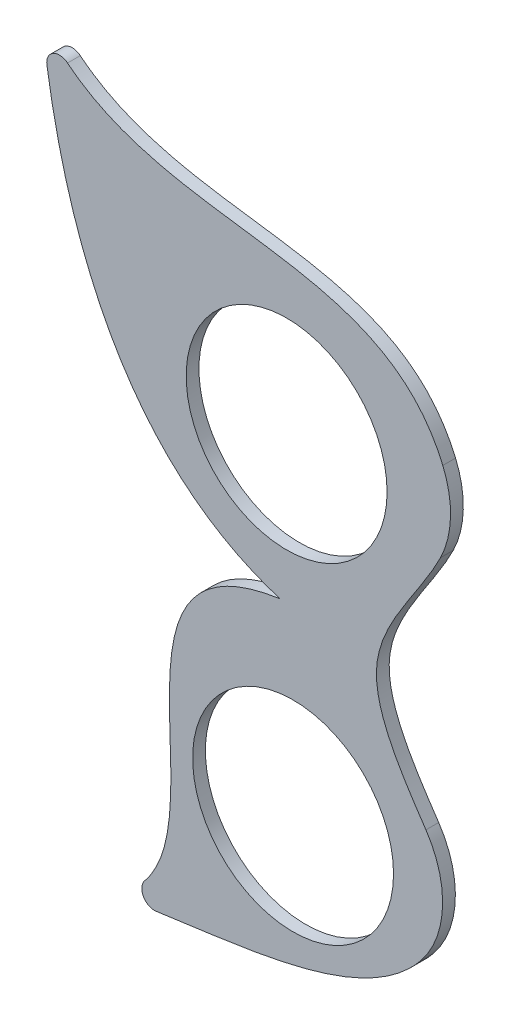
ISO-10303-21;
HEADER;
FILE_DESCRIPTION(('STEP AP214'),'2;1');
FILE_NAME('part.step','',(''),(''),'','','');
FILE_SCHEMA(('AUTOMOTIVE_DESIGN { 1 0 10303 214 1 1 1 1 }'));
ENDSEC;
DATA;
#1=APPLICATION_CONTEXT('core data for automotive mechanical design processes');
#2=APPLICATION_PROTOCOL_DEFINITION('international standard','automotive_design',2000,#1);
#3=PRODUCT_CONTEXT('',#1,'mechanical');
#4=PRODUCT('Part','Part','',(#3));
#5=PRODUCT_RELATED_PRODUCT_CATEGORY('part','',(#4));
#6=PRODUCT_DEFINITION_FORMATION('','',#4);
#7=PRODUCT_DEFINITION_CONTEXT('part definition',#1,'design');
#8=PRODUCT_DEFINITION('design','',#6,#7);
#9=PRODUCT_DEFINITION_SHAPE('','',#8);
#10=(LENGTH_UNIT() NAMED_UNIT(*) SI_UNIT(.MILLI.,.METRE.));
#11=(NAMED_UNIT(*) PLANE_ANGLE_UNIT() SI_UNIT($,.RADIAN.));
#12=(NAMED_UNIT(*) SI_UNIT($,.STERADIAN.) SOLID_ANGLE_UNIT());
#13=UNCERTAINTY_MEASURE_WITH_UNIT(LENGTH_MEASURE(1.E-05),#10,'distance_accuracy_value','');
#14=(GEOMETRIC_REPRESENTATION_CONTEXT(3) GLOBAL_UNCERTAINTY_ASSIGNED_CONTEXT((#13)) GLOBAL_UNIT_ASSIGNED_CONTEXT((#10,
#11,#12)) REPRESENTATION_CONTEXT('',''));
#15=CARTESIAN_POINT('',(0.,0.,0.));
#16=DIRECTION('',(0.,0.,1.));
#17=DIRECTION('',(1.,0.,0.));
#18=AXIS2_PLACEMENT_3D('',#15,#16,#17);
#19=CARTESIAN_POINT('',(47.4828996392039,257.347445507489,10.));
#20=DIRECTION('',(0.,0.,-1.));
#21=DIRECTION('',(-1.,0.,0.));
#22=AXIS2_PLACEMENT_3D('',#19,#20,#21);
#23=PLANE('',#22);
#24=CARTESIAN_POINT('',(54.2159168019038,24.2036270078242,10.));
#25=CARTESIAN_POINT('',(-114.622523084741,-0.554759509269772,10.));
#26=CARTESIAN_POINT('',(39.7835800245491,-196.678058189763,10.));
#27=CARTESIAN_POINT('',(-88.138107542117,-245.060353001385,10.));
#28=B_SPLINE_CURVE_WITH_KNOTS('',3,(#24,#25,#26,#27),.UNSPECIFIED.,.F.,.F.,(4,4),(0.,1.),.UNSPECIFIED.);
#29=CARTESIAN_POINT('',(54.2159168019038,24.2036270078242,10.));
#30=VERTEX_POINT('',#29);
#31=CARTESIAN_POINT('',(-51.8891233892457,-220.2154826426,10.));
#32=VERTEX_POINT('',#31);
#33=EDGE_CURVE('E107',#30,#32,#28,.T.);
#34=ORIENTED_EDGE('',*,*,#33,.T.);
#35=CARTESIAN_POINT('',(-44.1543989368596,-226.553781913356,10.));
#36=DIRECTION('',(0.,0.,-1.));
#37=DIRECTION('',(-1.,0.,0.));
#38=AXIS2_PLACEMENT_3D('',#35,#36,#37);
#39=CIRCLE('',#38,10.);
#40=CARTESIAN_POINT('',(-42.7045517097925,-236.448120851262,10.));
#41=VERTEX_POINT('',#40);
#42=EDGE_CURVE('E11',#32,#41,#39,.F.);
#43=ORIENTED_EDGE('',*,*,#42,.T.);
#44=CARTESIAN_POINT('',(-88.138107542117,-245.060353001385,10.));
#45=CARTESIAN_POINT('',(6.77991974455998,-220.260837551599,10.));
#46=CARTESIAN_POINT('',(192.981953107219,-238.762703419045,10.));
#47=CARTESIAN_POINT('',(190.267122197307,-81.8904100032855,10.));
#48=B_SPLINE_CURVE_WITH_KNOTS('',3,(#44,#45,#46,#47),.UNSPECIFIED.,.F.,.F.,(4,4),(0.,1.),.UNSPECIFIED.);
#49=CARTESIAN_POINT('',(164.242164409829,-166.605689524645,10.));
#50=VERTEX_POINT('',#49);
#51=EDGE_CURVE('E123',#41,#50,#48,.T.);
#52=ORIENTED_EDGE('',*,*,#51,.T.);
#53=CARTESIAN_POINT('',(105.398904119861,-118.191737832523,10.));
#54=DIRECTION('',(0.,0.,-1.));
#55=DIRECTION('',(-1.,0.,0.));
#56=AXIS2_PLACEMENT_3D('',#53,#54,#55);
#57=CIRCLE('',#56,76.2);
#58=CARTESIAN_POINT('',(168.517176001273,-75.5007112027481,10.));
#59=VERTEX_POINT('',#58);
#60=EDGE_CURVE('E240',#50,#59,#57,.F.);
#61=ORIENTED_EDGE('',*,*,#60,.T.);
#62=CARTESIAN_POINT('',(190.266087736568,151.118361081247,10.));
#63=CARTESIAN_POINT('',(188.54438455845,103.276758096037,10.));
#64=CARTESIAN_POINT('',(81.5182519384415,21.8324709749952,10.));
#65=CARTESIAN_POINT('',(169.063135255653,-71.6122126377603,10.));
#66=CARTESIAN_POINT('',(188.896265884834,-107.393898426108,10.));
#67=B_SPLINE_CURVE_WITH_KNOTS('',3,(#62,#63,#64,#65,#66),.UNSPECIFIED.,.F.,.F.,(4,1,4),(0.,
0.522420240880409,1.),.UNSPECIFIED.);
#68=CARTESIAN_POINT('',(179.918483640911,114.925711472104,10.));
#69=VERTEX_POINT('',#68);
#70=EDGE_CURVE('E179',#69,#59,#67,.T.);
#71=ORIENTED_EDGE('',*,*,#70,.F.);
#72=CARTESIAN_POINT('',(111.603532346206,148.682302378209,10.));
#73=DIRECTION('',(0.,0.,-1.));
#74=DIRECTION('',(-1.,0.,0.));
#75=AXIS2_PLACEMENT_3D('',#72,#73,#74);
#76=CIRCLE('',#75,76.2);
#77=CARTESIAN_POINT('',(181.739094609831,178.472282337336,10.));
#78=VERTEX_POINT('',#77);
#79=EDGE_CURVE('E242',#69,#78,#76,.F.);
#80=ORIENTED_EDGE('',*,*,#79,.T.);
#81=CARTESIAN_POINT('',(190.267122197307,151.113582673013,10.));
#82=CARTESIAN_POINT('',(155.786794972419,310.39638242184,10.));
#83=CARTESIAN_POINT('',(-48.436146721012,217.149869499924,10.));
#84=CARTESIAN_POINT('',(-132.455869837897,325.027225621604,10.));
#85=B_SPLINE_CURVE_WITH_KNOTS('',3,(#81,#82,#83,#84),.UNSPECIFIED.,.F.,.F.,(4,4),(0.,1.),.UNSPECIFIED.);
#86=CARTESIAN_POINT('',(-112.376539471981,304.546203403104,10.));
#87=VERTEX_POINT('',#86);
#88=EDGE_CURVE('E115',#78,#87,#85,.T.);
#89=ORIENTED_EDGE('',*,*,#88,.T.);
#90=CARTESIAN_POINT('',(-118.676678228364,296.780364642847,10.));
#91=DIRECTION('',(0.,0.,-1.));
#92=DIRECTION('',(-1.,0.,0.));
#93=AXIS2_PLACEMENT_3D('',#90,#91,#92);
#94=CIRCLE('',#93,10.);
#95=CARTESIAN_POINT('',(-128.562651531917,295.274532035467,10.));
#96=VERTEX_POINT('',#95);
#97=EDGE_CURVE('E111',#87,#96,#94,.F.);
#98=ORIENTED_EDGE('',*,*,#97,.T.);
#99=CARTESIAN_POINT('',(-132.455869837897,325.027225621604,10.));
#100=CARTESIAN_POINT('',(-119.39432206048,206.497464479189,10.));
#101=CARTESIAN_POINT('',(-75.4976315389797,64.0889860687004,10.));
#102=CARTESIAN_POINT('',(54.2159168019038,24.2036270078242,10.));
#103=B_SPLINE_CURVE_WITH_KNOTS('',3,(#99,#100,#101,#102),.UNSPECIFIED.,.F.,.F.,(4,4),(0.,1.),.UNSPECIFIED.);
#104=EDGE_CURVE('E104',#96,#30,#103,.T.);
#105=ORIENTED_EDGE('',*,*,#104,.T.);
#106=EDGE_LOOP('',(#34,#43,#52,#61,#71,#80,#89,#98,#105));
#107=FACE_BOUND('',#106,.T.);
#108=CARTESIAN_POINT('',(64.3918961169219,-118.081850955431,10.));
#109=DIRECTION('',(0.,0.,1.));
#110=DIRECTION('',(1.,0.,0.));
#111=AXIS2_PLACEMENT_3D('',#108,#109,#110);
#112=CIRCLE('',#111,78.74);
#113=CARTESIAN_POINT('',(143.131896116922,-118.081850955431,10.));
#114=VERTEX_POINT('',#113);
#115=EDGE_CURVE('E168',#114,#114,#112,.T.);
#116=ORIENTED_EDGE('',*,*,#115,.F.);
#117=EDGE_LOOP('',(#116));
#118=FACE_BOUND('',#117,.T.);
#119=CARTESIAN_POINT('',(59.3394098295253,138.616957423646,10.));
#120=DIRECTION('',(0.,0.,1.));
#121=DIRECTION('',(1.,0.,0.));
#122=AXIS2_PLACEMENT_3D('',#119,#120,#121);
#123=CIRCLE('',#122,78.74);
#124=CARTESIAN_POINT('',(138.079409829525,138.616957423646,10.));
#125=VERTEX_POINT('',#124);
#126=EDGE_CURVE('E169',#125,#125,#123,.T.);
#127=ORIENTED_EDGE('',*,*,#126,.F.);
#128=EDGE_LOOP('',(#127));
#129=FACE_BOUND('',#128,.T.);
#130=ADVANCED_FACE('F34',(#107,#118,#129),#23,.F.);
#131=CARTESIAN_POINT('',(47.4828996392039,257.347445507489,0.));
#132=DIRECTION('',(0.,0.,-1.));
#133=DIRECTION('',(-1.,0.,0.));
#134=AXIS2_PLACEMENT_3D('',#131,#132,#133);
#135=PLANE('',#134);
#136=CARTESIAN_POINT('',(-88.138107542117,-245.060353001385,0.));
#137=CARTESIAN_POINT('',(6.77991974455998,-220.260837551599,0.));
#138=CARTESIAN_POINT('',(192.981953107219,-238.762703419045,0.));
#139=CARTESIAN_POINT('',(190.267122197307,-81.8904100032855,0.));
#140=B_SPLINE_CURVE_WITH_KNOTS('',3,(#136,#137,#138,#139),.UNSPECIFIED.,.F.,.F.,(4,4),(0.,1.),.UNSPECIFIED.);
#141=CARTESIAN_POINT('',(-42.7045517097925,-236.448120851262,0.));
#142=VERTEX_POINT('',#141);
#143=CARTESIAN_POINT('',(164.242164409829,-166.605689524645,0.));
#144=VERTEX_POINT('',#143);
#145=EDGE_CURVE('E161',#142,#144,#140,.T.);
#146=ORIENTED_EDGE('',*,*,#145,.F.);
#147=CARTESIAN_POINT('',(-44.1543989368596,-226.553781913356,0.));
#148=DIRECTION('',(0.,0.,-1.));
#149=DIRECTION('',(-1.,0.,0.));
#150=AXIS2_PLACEMENT_3D('',#147,#148,#149);
#151=CIRCLE('',#150,10.);
#152=CARTESIAN_POINT('',(-51.8891233892457,-220.2154826426,0.));
#153=VERTEX_POINT('',#152);
#154=EDGE_CURVE('E56',#142,#153,#151,.T.);
#155=ORIENTED_EDGE('',*,*,#154,.T.);
#156=CARTESIAN_POINT('',(54.2159168019038,24.2036270078242,0.));
#157=CARTESIAN_POINT('',(-114.622523084741,-0.554759509269772,0.));
#158=CARTESIAN_POINT('',(39.7835800245491,-196.678058189763,0.));
#159=CARTESIAN_POINT('',(-88.138107542117,-245.060353001385,0.));
#160=B_SPLINE_CURVE_WITH_KNOTS('',3,(#156,#157,#158,#159),.UNSPECIFIED.,.F.,.F.,(4,4),(0.,1.),.UNSPECIFIED.);
#161=CARTESIAN_POINT('',(54.2159168019038,24.2036270078242,0.));
#162=VERTEX_POINT('',#161);
#163=EDGE_CURVE('E224',#162,#153,#160,.T.);
#164=ORIENTED_EDGE('',*,*,#163,.F.);
#165=CARTESIAN_POINT('',(-132.455869837897,325.027225621604,0.));
#166=CARTESIAN_POINT('',(-119.39432206048,206.497464479189,0.));
#167=CARTESIAN_POINT('',(-75.4976315389797,64.0889860687004,0.));
#168=CARTESIAN_POINT('',(54.2159168019038,24.2036270078242,0.));
#169=B_SPLINE_CURVE_WITH_KNOTS('',3,(#165,#166,#167,#168),.UNSPECIFIED.,.F.,.F.,(4,4),(0.,1.),.UNSPECIFIED.);
#170=CARTESIAN_POINT('',(-128.562651531917,295.274532035467,0.));
#171=VERTEX_POINT('',#170);
#172=EDGE_CURVE('E121',#171,#162,#169,.T.);
#173=ORIENTED_EDGE('',*,*,#172,.F.);
#174=CARTESIAN_POINT('',(-118.676678228364,296.780364642847,0.));
#175=DIRECTION('',(0.,0.,-1.));
#176=DIRECTION('',(-1.,0.,0.));
#177=AXIS2_PLACEMENT_3D('',#174,#175,#176);
#178=CIRCLE('',#177,10.);
#179=CARTESIAN_POINT('',(-112.376539471981,304.546203403104,0.));
#180=VERTEX_POINT('',#179);
#181=EDGE_CURVE('E253',#171,#180,#178,.T.);
#182=ORIENTED_EDGE('',*,*,#181,.T.);
#183=CARTESIAN_POINT('',(190.267122197307,151.113582673013,0.));
#184=CARTESIAN_POINT('',(155.786794972419,310.39638242184,0.));
#185=CARTESIAN_POINT('',(-48.436146721012,217.149869499924,0.));
#186=CARTESIAN_POINT('',(-132.455869837897,325.027225621604,0.));
#187=B_SPLINE_CURVE_WITH_KNOTS('',3,(#183,#184,#185,#186),.UNSPECIFIED.,.F.,.F.,(4,4),(0.,1.),.UNSPECIFIED.);
#188=CARTESIAN_POINT('',(181.739094609831,178.472282337336,0.));
#189=VERTEX_POINT('',#188);
#190=EDGE_CURVE('E172',#189,#180,#187,.T.);
#191=ORIENTED_EDGE('',*,*,#190,.F.);
#192=CARTESIAN_POINT('',(111.603532346206,148.682302378209,0.));
#193=DIRECTION('',(0.,0.,-1.));
#194=DIRECTION('',(-1.,0.,0.));
#195=AXIS2_PLACEMENT_3D('',#192,#193,#194);
#196=CIRCLE('',#195,76.2);
#197=CARTESIAN_POINT('',(179.918483640911,114.925711472104,0.));
#198=VERTEX_POINT('',#197);
#199=EDGE_CURVE('E247',#189,#198,#196,.T.);
#200=ORIENTED_EDGE('',*,*,#199,.T.);
#201=CARTESIAN_POINT('',(190.266087736568,151.118361081247,0.));
#202=CARTESIAN_POINT('',(188.54438455845,103.276758096037,0.));
#203=CARTESIAN_POINT('',(81.5182519384415,21.8324709749952,0.));
#204=CARTESIAN_POINT('',(169.063135255653,-71.6122126377603,0.));
#205=CARTESIAN_POINT('',(188.896265884834,-107.393898426108,0.));
#206=B_SPLINE_CURVE_WITH_KNOTS('',3,(#201,#202,#203,#204,#205),.UNSPECIFIED.,.F.,.F.,(4,1,4),
(0.,0.522420240880409,1.),.UNSPECIFIED.);
#207=CARTESIAN_POINT('',(168.517176001273,-75.5007112027481,0.));
#208=VERTEX_POINT('',#207);
#209=EDGE_CURVE('E176',#198,#208,#206,.T.);
#210=ORIENTED_EDGE('',*,*,#209,.T.);
#211=CARTESIAN_POINT('',(105.398904119861,-118.191737832523,0.));
#212=DIRECTION('',(0.,0.,-1.));
#213=DIRECTION('',(-1.,0.,0.));
#214=AXIS2_PLACEMENT_3D('',#211,#212,#213);
#215=CIRCLE('',#214,76.2);
#216=EDGE_CURVE('E219',#208,#144,#215,.T.);
#217=ORIENTED_EDGE('',*,*,#216,.T.);
#218=EDGE_LOOP('',(#146,#155,#164,#173,#182,#191,#200,#210,#217));
#219=FACE_BOUND('',#218,.T.);
#220=CARTESIAN_POINT('',(64.3918961169219,-118.081850955431,0.));
#221=DIRECTION('',(0.,0.,1.));
#222=DIRECTION('',(1.,0.,0.));
#223=AXIS2_PLACEMENT_3D('',#220,#221,#222);
#224=CIRCLE('',#223,78.74);
#225=CARTESIAN_POINT('',(143.131896116922,-118.081850955431,0.));
#226=VERTEX_POINT('',#225);
#227=EDGE_CURVE('E162',#226,#226,#224,.T.);
#228=ORIENTED_EDGE('',*,*,#227,.T.);
#229=EDGE_LOOP('',(#228));
#230=FACE_BOUND('',#229,.T.);
#231=CARTESIAN_POINT('',(59.3394098295253,138.616957423646,0.));
#232=DIRECTION('',(0.,0.,1.));
#233=DIRECTION('',(1.,0.,0.));
#234=AXIS2_PLACEMENT_3D('',#231,#232,#233);
#235=CIRCLE('',#234,78.74);
#236=CARTESIAN_POINT('',(138.079409829525,138.616957423646,0.));
#237=VERTEX_POINT('',#236);
#238=EDGE_CURVE('E173',#237,#237,#235,.T.);
#239=ORIENTED_EDGE('',*,*,#238,.T.);
#240=EDGE_LOOP('',(#239));
#241=FACE_BOUND('',#240,.T.);
#242=ADVANCED_FACE('F153',(#219,#230,#241),#135,.T.);
#243=DIRECTION('',(0.,0.,-1.));
#244=VECTOR('',#243,1.);
#245=SURFACE_OF_LINEAR_EXTRUSION('',#85,#244);
#246=ORIENTED_EDGE('',*,*,#190,.T.);
#247=DIRECTION('',(0.,0.,-1.));
#248=VECTOR('',#247,1.);
#249=CARTESIAN_POINT('',(-112.376539471981,304.546203403104,0.));
#250=LINE('',#249,#248);
#251=EDGE_CURVE('E255',#180,#87,#250,.F.);
#252=ORIENTED_EDGE('',*,*,#251,.T.);
#253=ORIENTED_EDGE('',*,*,#88,.F.);
#254=DIRECTION('',(0.,0.,-1.));
#255=VECTOR('',#254,1.);
#256=CARTESIAN_POINT('',(181.739094609831,178.472282337336,10.));
#257=LINE('',#256,#255);
#258=EDGE_CURVE('E244',#78,#189,#257,.T.);
#259=ORIENTED_EDGE('',*,*,#258,.T.);
#260=EDGE_LOOP('',(#246,#252,#253,#259));
#261=FACE_BOUND('',#260,.T.);
#262=ADVANCED_FACE('F150',(#261),#245,.F.);
#263=DIRECTION('',(0.,0.,-1.));
#264=VECTOR('',#263,1.);
#265=SURFACE_OF_LINEAR_EXTRUSION('',#103,#264);
#266=ORIENTED_EDGE('',*,*,#104,.F.);
#267=DIRECTION('',(0.,0.,-1.));
#268=VECTOR('',#267,1.);
#269=CARTESIAN_POINT('',(-128.562651531917,295.274532035467,10.));
#270=LINE('',#269,#268);
#271=EDGE_CURVE('E251',#96,#171,#270,.T.);
#272=ORIENTED_EDGE('',*,*,#271,.T.);
#273=ORIENTED_EDGE('',*,*,#172,.T.);
#274=DIRECTION('',(0.,0.,-1.));
#275=VECTOR('',#274,1.);
#276=CARTESIAN_POINT('',(54.2159168019038,24.2036270078242,10.));
#277=LINE('',#276,#275);
#278=EDGE_CURVE('E118',#30,#162,#277,.T.);
#279=ORIENTED_EDGE('',*,*,#278,.F.);
#280=EDGE_LOOP('',(#266,#272,#273,#279));
#281=FACE_BOUND('',#280,.T.);
#282=ADVANCED_FACE('F119',(#281),#265,.F.);
#283=DIRECTION('',(0.,0.,-1.));
#284=VECTOR('',#283,1.);
#285=SURFACE_OF_LINEAR_EXTRUSION('',#28,#284);
#286=ORIENTED_EDGE('',*,*,#163,.T.);
#287=DIRECTION('',(0.,0.,-1.));
#288=VECTOR('',#287,1.);
#289=CARTESIAN_POINT('',(-51.8891233892457,-220.2154826426,0.));
#290=LINE('',#289,#288);
#291=EDGE_CURVE('E42',#153,#32,#290,.F.);
#292=ORIENTED_EDGE('',*,*,#291,.T.);
#293=ORIENTED_EDGE('',*,*,#33,.F.);
#294=ORIENTED_EDGE('',*,*,#278,.T.);
#295=EDGE_LOOP('',(#286,#292,#293,#294));
#296=FACE_BOUND('',#295,.T.);
#297=ADVANCED_FACE('F125',(#296),#285,.F.);
#298=DIRECTION('',(0.,0.,-1.));
#299=VECTOR('',#298,1.);
#300=SURFACE_OF_LINEAR_EXTRUSION('',#48,#299);
#301=ORIENTED_EDGE('',*,*,#51,.F.);
#302=DIRECTION('',(0.,0.,-1.));
#303=VECTOR('',#302,1.);
#304=CARTESIAN_POINT('',(-42.7045517097925,-236.448120851262,10.));
#305=LINE('',#304,#303);
#306=EDGE_CURVE('E258',#41,#142,#305,.T.);
#307=ORIENTED_EDGE('',*,*,#306,.T.);
#308=ORIENTED_EDGE('',*,*,#145,.T.);
#309=DIRECTION('',(0.,0.,-1.));
#310=VECTOR('',#309,1.);
#311=CARTESIAN_POINT('',(164.242164409829,-166.605689524645,0.));
#312=LINE('',#311,#310);
#313=EDGE_CURVE('E249',#144,#50,#312,.F.);
#314=ORIENTED_EDGE('',*,*,#313,.T.);
#315=EDGE_LOOP('',(#301,#307,#308,#314));
#316=FACE_BOUND('',#315,.T.);
#317=ADVANCED_FACE('F146',(#316),#300,.F.);
#318=CARTESIAN_POINT('',(64.3918961169219,-118.081850955431,10.));
#319=DIRECTION('',(0.,0.,-1.));
#320=DIRECTION('',(-1.,0.,0.));
#321=AXIS2_PLACEMENT_3D('',#318,#319,#320);
#322=CYLINDRICAL_SURFACE('',#321,78.74);
#323=ORIENTED_EDGE('',*,*,#115,.T.);
#324=EDGE_LOOP('',(#323));
#325=FACE_BOUND('',#324,.T.);
#326=ORIENTED_EDGE('',*,*,#227,.F.);
#327=EDGE_LOOP('',(#326));
#328=FACE_BOUND('',#327,.T.);
#329=ADVANCED_FACE('F202',(#325,#328),#322,.F.);
#330=CARTESIAN_POINT('',(59.3394098295253,138.616957423646,10.));
#331=DIRECTION('',(0.,0.,-1.));
#332=DIRECTION('',(-1.,0.,0.));
#333=AXIS2_PLACEMENT_3D('',#330,#331,#332);
#334=CYLINDRICAL_SURFACE('',#333,78.74);
#335=ORIENTED_EDGE('',*,*,#126,.T.);
#336=EDGE_LOOP('',(#335));
#337=FACE_BOUND('',#336,.T.);
#338=ORIENTED_EDGE('',*,*,#238,.F.);
#339=EDGE_LOOP('',(#338));
#340=FACE_BOUND('',#339,.T.);
#341=ADVANCED_FACE('F198',(#337,#340),#334,.F.);
#342=DIRECTION('',(0.,0.,1.));
#343=VECTOR('',#342,1.);
#344=SURFACE_OF_LINEAR_EXTRUSION('',#206,#343);
#345=ORIENTED_EDGE('',*,*,#209,.F.);
#346=DIRECTION('',(0.,0.,1.));
#347=VECTOR('',#346,1.);
#348=CARTESIAN_POINT('',(179.918483640911,114.925711472104,0.));
#349=LINE('',#348,#347);
#350=EDGE_CURVE('E237',#198,#69,#349,.T.);
#351=ORIENTED_EDGE('',*,*,#350,.T.);
#352=ORIENTED_EDGE('',*,*,#70,.T.);
#353=DIRECTION('',(0.,0.,1.));
#354=VECTOR('',#353,1.);
#355=CARTESIAN_POINT('',(168.517176001273,-75.5007112027481,10.));
#356=LINE('',#355,#354);
#357=EDGE_CURVE('E122',#59,#208,#356,.F.);
#358=ORIENTED_EDGE('',*,*,#357,.T.);
#359=EDGE_LOOP('',(#345,#351,#352,#358));
#360=FACE_BOUND('',#359,.T.);
#361=ADVANCED_FACE('F195',(#360),#344,.F.);
#362=CARTESIAN_POINT('',(111.603532346206,148.682302378209,0.));
#363=DIRECTION('',(0.,0.,-1.));
#364=DIRECTION('',(-1.,0.,0.));
#365=AXIS2_PLACEMENT_3D('',#362,#363,#364);
#366=CYLINDRICAL_SURFACE('',#365,76.2);
#367=ORIENTED_EDGE('',*,*,#199,.F.);
#368=ORIENTED_EDGE('',*,*,#258,.F.);
#369=ORIENTED_EDGE('',*,*,#79,.F.);
#370=ORIENTED_EDGE('',*,*,#350,.F.);
#371=EDGE_LOOP('',(#367,#368,#369,#370));
#372=FACE_BOUND('',#371,.T.);
#373=ADVANCED_FACE('F155',(#372),#366,.T.);
#374=CARTESIAN_POINT('',(105.398904119861,-118.191737832523,5.));
#375=DIRECTION('',(0.,0.,1.));
#376=DIRECTION('',(1.,0.,0.));
#377=AXIS2_PLACEMENT_3D('',#374,#375,#376);
#378=CYLINDRICAL_SURFACE('',#377,76.2);
#379=ORIENTED_EDGE('',*,*,#216,.F.);
#380=ORIENTED_EDGE('',*,*,#357,.F.);
#381=ORIENTED_EDGE('',*,*,#60,.F.);
#382=ORIENTED_EDGE('',*,*,#313,.F.);
#383=EDGE_LOOP('',(#379,#380,#381,#382));
#384=FACE_BOUND('',#383,.T.);
#385=ADVANCED_FACE('F267',(#384),#378,.T.);
#386=CARTESIAN_POINT('',(-118.676678228364,296.780364642847,5.));
#387=DIRECTION('',(0.,0.,-1.));
#388=DIRECTION('',(-1.,0.,0.));
#389=AXIS2_PLACEMENT_3D('',#386,#387,#388);
#390=CYLINDRICAL_SURFACE('',#389,10.);
#391=ORIENTED_EDGE('',*,*,#97,.F.);
#392=ORIENTED_EDGE('',*,*,#251,.F.);
#393=ORIENTED_EDGE('',*,*,#181,.F.);
#394=ORIENTED_EDGE('',*,*,#271,.F.);
#395=EDGE_LOOP('',(#391,#392,#393,#394));
#396=FACE_BOUND('',#395,.T.);
#397=ADVANCED_FACE('F278',(#396),#390,.T.);
#398=CARTESIAN_POINT('',(-44.1543989368596,-226.553781913356,5.00000000000001));
#399=DIRECTION('',(0.,0.,-1.));
#400=DIRECTION('',(-1.,0.,0.));
#401=AXIS2_PLACEMENT_3D('',#398,#399,#400);
#402=CYLINDRICAL_SURFACE('',#401,10.);
#403=ORIENTED_EDGE('',*,*,#42,.F.);
#404=ORIENTED_EDGE('',*,*,#291,.F.);
#405=ORIENTED_EDGE('',*,*,#154,.F.);
#406=ORIENTED_EDGE('',*,*,#306,.F.);
#407=EDGE_LOOP('',(#403,#404,#405,#406));
#408=FACE_BOUND('',#407,.T.);
#409=ADVANCED_FACE('F36',(#408),#402,.T.);
#410=CLOSED_SHELL('',(#130,#242,#262,#282,#297,#317,#329,#341,#361,#373,#385,#397,#409));
#411=MANIFOLD_SOLID_BREP('B2',#410);
#412=ADVANCED_BREP_SHAPE_REPRESENTATION('',(#18,#411),#14);
#413=SHAPE_DEFINITION_REPRESENTATION(#9,#412);
ENDSEC;
END-ISO-10303-21;
